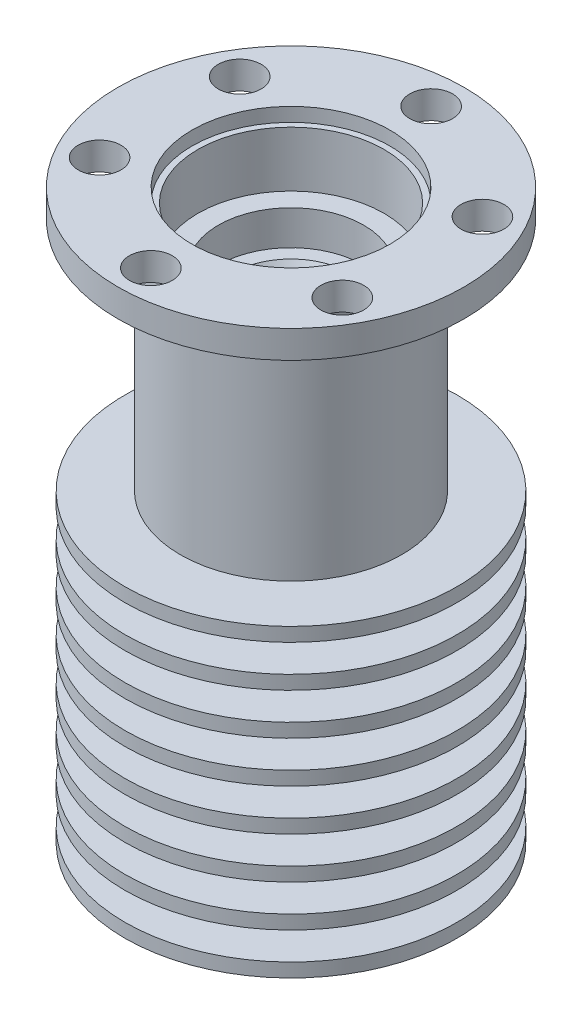
ISO-10303-21;
HEADER;
FILE_DESCRIPTION(('STEP AP214'),'2;1');
FILE_NAME('part.step','',(''),(''),'','','');
FILE_SCHEMA(('AUTOMOTIVE_DESIGN { 1 0 10303 214 1 1 1 1 }'));
ENDSEC;
DATA;
#1=APPLICATION_CONTEXT('core data for automotive mechanical design processes');
#2=APPLICATION_PROTOCOL_DEFINITION('international standard','automotive_design',2000,#1);
#3=PRODUCT_CONTEXT('',#1,'mechanical');
#4=PRODUCT('Part','Part','',(#3));
#5=PRODUCT_RELATED_PRODUCT_CATEGORY('part','',(#4));
#6=PRODUCT_DEFINITION_FORMATION('','',#4);
#7=PRODUCT_DEFINITION_CONTEXT('part definition',#1,'design');
#8=PRODUCT_DEFINITION('design','',#6,#7);
#9=PRODUCT_DEFINITION_SHAPE('','',#8);
#10=(LENGTH_UNIT() NAMED_UNIT(*) SI_UNIT(.MILLI.,.METRE.));
#11=(NAMED_UNIT(*) PLANE_ANGLE_UNIT() SI_UNIT($,.RADIAN.));
#12=(NAMED_UNIT(*) SI_UNIT($,.STERADIAN.) SOLID_ANGLE_UNIT());
#13=UNCERTAINTY_MEASURE_WITH_UNIT(LENGTH_MEASURE(1.E-05),#10,'distance_accuracy_value','');
#14=(GEOMETRIC_REPRESENTATION_CONTEXT(3) GLOBAL_UNCERTAINTY_ASSIGNED_CONTEXT((#13)) GLOBAL_UNIT_ASSIGNED_CONTEXT((#10,
#11,#12)) REPRESENTATION_CONTEXT('',''));
#15=CARTESIAN_POINT('',(0.,0.,0.));
#16=DIRECTION('',(0.,0.,1.));
#17=DIRECTION('',(1.,0.,0.));
#18=AXIS2_PLACEMENT_3D('',#15,#16,#17);
#19=CARTESIAN_POINT('',(0.,0.,0.));
#20=DIRECTION('',(0.,-1.,0.));
#21=DIRECTION('',(0.,0.,-1.));
#22=AXIS2_PLACEMENT_3D('',#19,#20,#21);
#23=CYLINDRICAL_SURFACE('',#22,6.725);
#24=CARTESIAN_POINT('',(0.,36.,0.));
#25=DIRECTION('',(0.,-1.,0.));
#26=DIRECTION('',(0.,0.,-1.));
#27=AXIS2_PLACEMENT_3D('',#24,#25,#26);
#28=CIRCLE('',#27,6.725);
#29=CARTESIAN_POINT('',(0.,36.,-6.725));
#30=VERTEX_POINT('',#29);
#31=EDGE_CURVE('E156',#30,#30,#28,.T.);
#32=ORIENTED_EDGE('',*,*,#31,.T.);
#33=EDGE_LOOP('',(#32));
#34=FACE_BOUND('',#33,.T.);
#35=CARTESIAN_POINT('',(0.,40.,0.));
#36=DIRECTION('',(0.,1.,0.));
#37=DIRECTION('',(-1.,0.,0.));
#38=AXIS2_PLACEMENT_3D('',#35,#36,#37);
#39=CIRCLE('',#38,6.725);
#40=CARTESIAN_POINT('',(-6.725,40.,0.));
#41=VERTEX_POINT('',#40);
#42=EDGE_CURVE('E69',#41,#41,#39,.F.);
#43=ORIENTED_EDGE('',*,*,#42,.F.);
#44=EDGE_LOOP('',(#43));
#45=FACE_BOUND('',#44,.T.);
#46=ADVANCED_FACE('F40',(#34,#45),#23,.F.);
#47=CARTESIAN_POINT('',(0.,41.,0.));
#48=DIRECTION('',(0.,1.,0.));
#49=DIRECTION('',(0.,0.,1.));
#50=AXIS2_PLACEMENT_3D('',#47,#48,#49);
#51=CYLINDRICAL_SURFACE('',#50,4.75);
#52=CARTESIAN_POINT('',(0.,21.,0.));
#53=DIRECTION('',(0.,-1.,0.));
#54=DIRECTION('',(0.,0.,-1.));
#55=AXIS2_PLACEMENT_3D('',#52,#53,#54);
#56=CIRCLE('',#55,4.75);
#57=CARTESIAN_POINT('',(0.,21.,-4.75));
#58=VERTEX_POINT('',#57);
#59=EDGE_CURVE('E229',#58,#58,#56,.T.);
#60=ORIENTED_EDGE('',*,*,#59,.T.);
#61=EDGE_LOOP('',(#60));
#62=FACE_BOUND('',#61,.T.);
#63=CARTESIAN_POINT('',(0.,19.,0.));
#64=DIRECTION('',(0.,-1.,0.));
#65=DIRECTION('',(0.,0.,-1.));
#66=AXIS2_PLACEMENT_3D('',#63,#64,#65);
#67=CIRCLE('',#66,4.75);
#68=CARTESIAN_POINT('',(0.,19.,-4.75));
#69=VERTEX_POINT('',#68);
#70=EDGE_CURVE('E82',#69,#69,#67,.T.);
#71=ORIENTED_EDGE('',*,*,#70,.F.);
#72=EDGE_LOOP('',(#71));
#73=FACE_BOUND('',#72,.T.);
#74=ADVANCED_FACE('F361',(#62,#73),#51,.T.);
#75=CARTESIAN_POINT('',(0.,18.,0.));
#76=DIRECTION('',(0.,-1.,0.));
#77=DIRECTION('',(0.,0.,-1.));
#78=AXIS2_PLACEMENT_3D('',#75,#76,#77);
#79=CIRCLE('',#78,4.75);
#80=CARTESIAN_POINT('',(0.,18.,-4.75));
#81=VERTEX_POINT('',#80);
#82=EDGE_CURVE('E208',#81,#81,#79,.T.);
#83=ORIENTED_EDGE('',*,*,#82,.T.);
#84=EDGE_LOOP('',(#83));
#85=FACE_BOUND('',#84,.T.);
#86=CARTESIAN_POINT('',(0.,16.,0.));
#87=DIRECTION('',(0.,-1.,0.));
#88=DIRECTION('',(0.,0.,-1.));
#89=AXIS2_PLACEMENT_3D('',#86,#87,#88);
#90=CIRCLE('',#89,4.75);
#91=CARTESIAN_POINT('',(0.,16.,-4.75));
#92=VERTEX_POINT('',#91);
#93=EDGE_CURVE('E87',#92,#92,#90,.T.);
#94=ORIENTED_EDGE('',*,*,#93,.F.);
#95=EDGE_LOOP('',(#94));
#96=FACE_BOUND('',#95,.T.);
#97=ADVANCED_FACE('F367',(#85,#96),#51,.T.);
#98=CARTESIAN_POINT('',(0.,15.,0.));
#99=DIRECTION('',(0.,-1.,0.));
#100=DIRECTION('',(0.,0.,-1.));
#101=AXIS2_PLACEMENT_3D('',#98,#99,#100);
#102=CIRCLE('',#101,4.75);
#103=CARTESIAN_POINT('',(0.,15.,-4.75));
#104=VERTEX_POINT('',#103);
#105=EDGE_CURVE('E193',#104,#104,#102,.T.);
#106=ORIENTED_EDGE('',*,*,#105,.T.);
#107=EDGE_LOOP('',(#106));
#108=FACE_BOUND('',#107,.T.);
#109=CARTESIAN_POINT('',(0.,13.,0.));
#110=DIRECTION('',(0.,-1.,0.));
#111=DIRECTION('',(0.,0.,-1.));
#112=AXIS2_PLACEMENT_3D('',#109,#110,#111);
#113=CIRCLE('',#112,4.75);
#114=CARTESIAN_POINT('',(0.,13.,-4.75));
#115=VERTEX_POINT('',#114);
#116=EDGE_CURVE('E83',#115,#115,#113,.T.);
#117=ORIENTED_EDGE('',*,*,#116,.F.);
#118=EDGE_LOOP('',(#117));
#119=FACE_BOUND('',#118,.T.);
#120=ADVANCED_FACE('F370',(#108,#119),#51,.T.);
#121=CARTESIAN_POINT('',(0.,41.,0.));
#122=DIRECTION('',(0.,1.,0.));
#123=DIRECTION('',(0.,0.,1.));
#124=AXIS2_PLACEMENT_3D('',#121,#122,#123);
#125=CYLINDRICAL_SURFACE('',#124,5.25);
#126=CARTESIAN_POINT('',(0.,12.,0.));
#127=DIRECTION('',(0.,1.,0.));
#128=DIRECTION('',(0.,0.,1.));
#129=AXIS2_PLACEMENT_3D('',#126,#127,#128);
#130=CIRCLE('',#129,5.25);
#131=CARTESIAN_POINT('',(0.,12.,5.25));
#132=VERTEX_POINT('',#131);
#133=EDGE_CURVE('E120',#132,#132,#130,.T.);
#134=ORIENTED_EDGE('',*,*,#133,.F.);
#135=EDGE_LOOP('',(#134));
#136=FACE_BOUND('',#135,.T.);
#137=CARTESIAN_POINT('',(0.,10.,0.));
#138=DIRECTION('',(0.,-1.,0.));
#139=DIRECTION('',(0.,0.,-1.));
#140=AXIS2_PLACEMENT_3D('',#137,#138,#139);
#141=CIRCLE('',#140,5.25);
#142=CARTESIAN_POINT('',(0.,10.,-5.25));
#143=VERTEX_POINT('',#142);
#144=EDGE_CURVE('E88',#143,#143,#141,.T.);
#145=ORIENTED_EDGE('',*,*,#144,.F.);
#146=EDGE_LOOP('',(#145));
#147=FACE_BOUND('',#146,.T.);
#148=ADVANCED_FACE('F411',(#136,#147),#125,.T.);
#149=CARTESIAN_POINT('',(0.,41.,0.));
#150=DIRECTION('',(0.,1.,0.));
#151=DIRECTION('',(0.,0.,1.));
#152=AXIS2_PLACEMENT_3D('',#149,#150,#151);
#153=CYLINDRICAL_SURFACE('',#152,6.);
#154=CARTESIAN_POINT('',(0.,9.,0.));
#155=DIRECTION('',(0.,1.,0.));
#156=DIRECTION('',(0.,0.,1.));
#157=AXIS2_PLACEMENT_3D('',#154,#155,#156);
#158=CIRCLE('',#157,6.);
#159=CARTESIAN_POINT('',(0.,9.,6.));
#160=VERTEX_POINT('',#159);
#161=EDGE_CURVE('E116',#160,#160,#158,.T.);
#162=ORIENTED_EDGE('',*,*,#161,.F.);
#163=EDGE_LOOP('',(#162));
#164=FACE_BOUND('',#163,.T.);
#165=CARTESIAN_POINT('',(0.,7.,0.));
#166=DIRECTION('',(0.,-1.,0.));
#167=DIRECTION('',(0.,0.,-1.));
#168=AXIS2_PLACEMENT_3D('',#165,#166,#167);
#169=CIRCLE('',#168,6.);
#170=CARTESIAN_POINT('',(0.,7.,-6.));
#171=VERTEX_POINT('',#170);
#172=EDGE_CURVE('E92',#171,#171,#169,.T.);
#173=ORIENTED_EDGE('',*,*,#172,.F.);
#174=EDGE_LOOP('',(#173));
#175=FACE_BOUND('',#174,.T.);
#176=ADVANCED_FACE('F415',(#164,#175),#153,.T.);
#177=CARTESIAN_POINT('',(0.,6.,0.));
#178=DIRECTION('',(0.,-1.,0.));
#179=DIRECTION('',(0.,0.,-1.));
#180=AXIS2_PLACEMENT_3D('',#177,#178,#179);
#181=CIRCLE('',#180,6.);
#182=CARTESIAN_POINT('',(0.,6.,-6.));
#183=VERTEX_POINT('',#182);
#184=EDGE_CURVE('E97',#183,#183,#181,.T.);
#185=ORIENTED_EDGE('',*,*,#184,.T.);
#186=EDGE_LOOP('',(#185));
#187=FACE_BOUND('',#186,.T.);
#188=CARTESIAN_POINT('',(0.,4.,0.));
#189=DIRECTION('',(0.,-1.,0.));
#190=DIRECTION('',(0.,0.,-1.));
#191=AXIS2_PLACEMENT_3D('',#188,#189,#190);
#192=CIRCLE('',#191,6.);
#193=CARTESIAN_POINT('',(0.,4.,-6.));
#194=VERTEX_POINT('',#193);
#195=EDGE_CURVE('E96',#194,#194,#192,.T.);
#196=ORIENTED_EDGE('',*,*,#195,.F.);
#197=EDGE_LOOP('',(#196));
#198=FACE_BOUND('',#197,.T.);
#199=ADVANCED_FACE('F419',(#187,#198),#153,.T.);
#200=CARTESIAN_POINT('',(0.,3.,0.));
#201=DIRECTION('',(0.,-1.,0.));
#202=DIRECTION('',(0.,0.,-1.));
#203=AXIS2_PLACEMENT_3D('',#200,#201,#202);
#204=CIRCLE('',#203,6.);
#205=CARTESIAN_POINT('',(0.,3.,-6.));
#206=VERTEX_POINT('',#205);
#207=EDGE_CURVE('E107',#206,#206,#204,.T.);
#208=ORIENTED_EDGE('',*,*,#207,.T.);
#209=EDGE_LOOP('',(#208));
#210=FACE_BOUND('',#209,.T.);
#211=CARTESIAN_POINT('',(0.,1.,0.));
#212=DIRECTION('',(0.,-1.,0.));
#213=DIRECTION('',(0.,0.,-1.));
#214=AXIS2_PLACEMENT_3D('',#211,#212,#213);
#215=CIRCLE('',#214,6.);
#216=CARTESIAN_POINT('',(0.,1.,-6.));
#217=VERTEX_POINT('',#216);
#218=EDGE_CURVE('E106',#217,#217,#215,.T.);
#219=ORIENTED_EDGE('',*,*,#218,.F.);
#220=EDGE_LOOP('',(#219));
#221=FACE_BOUND('',#220,.T.);
#222=ADVANCED_FACE('F338',(#210,#221),#153,.T.);
#223=CARTESIAN_POINT('',(0.,41.,0.));
#224=DIRECTION('',(0.,1.,0.));
#225=DIRECTION('',(0.,0.,1.));
#226=AXIS2_PLACEMENT_3D('',#223,#224,#225);
#227=CYLINDRICAL_SURFACE('',#226,8.);
#228=CARTESIAN_POINT('',(0.,39.,0.));
#229=DIRECTION('',(0.,1.,0.));
#230=DIRECTION('',(0.,0.,1.));
#231=AXIS2_PLACEMENT_3D('',#228,#229,#230);
#232=CIRCLE('',#231,8.);
#233=CARTESIAN_POINT('',(0.,39.,8.));
#234=VERTEX_POINT('',#233);
#235=EDGE_CURVE('E124',#234,#234,#232,.T.);
#236=ORIENTED_EDGE('',*,*,#235,.F.);
#237=EDGE_LOOP('',(#236));
#238=FACE_BOUND('',#237,.T.);
#239=CARTESIAN_POINT('',(0.,22.,0.));
#240=DIRECTION('',(0.,-1.,0.));
#241=DIRECTION('',(0.,0.,-1.));
#242=AXIS2_PLACEMENT_3D('',#239,#240,#241);
#243=CIRCLE('',#242,8.);
#244=CARTESIAN_POINT('',(0.,22.,-8.));
#245=VERTEX_POINT('',#244);
#246=EDGE_CURVE('E222',#245,#245,#243,.T.);
#247=ORIENTED_EDGE('',*,*,#246,.F.);
#248=EDGE_LOOP('',(#247));
#249=FACE_BOUND('',#248,.T.);
#250=ADVANCED_FACE('F331',(#238,#249),#227,.T.);
#251=CARTESIAN_POINT('',(8.,39.,0.));
#252=DIRECTION('',(0.,1.,0.));
#253=DIRECTION('',(0.,0.,1.));
#254=AXIS2_PLACEMENT_3D('',#251,#252,#253);
#255=PLANE('',#254);
#256=CARTESIAN_POINT('',(8.76850721331738,39.,-5.0625000000001));
#257=DIRECTION('',(0.,1.,0.));
#258=DIRECTION('',(0.,0.,1.));
#259=AXIS2_PLACEMENT_3D('',#256,#257,#258);
#260=CIRCLE('',#259,1.55);
#261=CARTESIAN_POINT('',(8.76850721331738,39.,-3.5125000000001));
#262=VERTEX_POINT('',#261);
#263=EDGE_CURVE('E277',#262,#262,#260,.F.);
#264=ORIENTED_EDGE('',*,*,#263,.F.);
#265=EDGE_LOOP('',(#264));
#266=FACE_BOUND('',#265,.T.);
#267=CARTESIAN_POINT('',(8.76850721331749,39.,5.06249999999992));
#268=DIRECTION('',(0.,1.,0.));
#269=DIRECTION('',(0.,0.,1.));
#270=AXIS2_PLACEMENT_3D('',#267,#268,#269);
#271=CIRCLE('',#270,1.55);
#272=CARTESIAN_POINT('',(8.76850721331749,39.,6.61249999999992));
#273=VERTEX_POINT('',#272);
#274=EDGE_CURVE('E269',#273,#273,#271,.F.);
#275=ORIENTED_EDGE('',*,*,#274,.F.);
#276=EDGE_LOOP('',(#275));
#277=FACE_BOUND('',#276,.T.);
#278=CARTESIAN_POINT('',(0.,39.,10.125));
#279=DIRECTION('',(0.,1.,0.));
#280=DIRECTION('',(0.,0.,1.));
#281=AXIS2_PLACEMENT_3D('',#278,#279,#280);
#282=CIRCLE('',#281,1.55);
#283=CARTESIAN_POINT('',(0.,39.,11.675));
#284=VERTEX_POINT('',#283);
#285=EDGE_CURVE('E261',#284,#284,#282,.F.);
#286=ORIENTED_EDGE('',*,*,#285,.F.);
#287=EDGE_LOOP('',(#286));
#288=FACE_BOUND('',#287,.T.);
#289=CARTESIAN_POINT('',(-8.76850721331742,39.,5.06250000000004));
#290=DIRECTION('',(0.,1.,0.));
#291=DIRECTION('',(0.,0.,1.));
#292=AXIS2_PLACEMENT_3D('',#289,#290,#291);
#293=CIRCLE('',#292,1.55);
#294=CARTESIAN_POINT('',(-8.76850721331742,39.,6.61250000000004));
#295=VERTEX_POINT('',#294);
#296=EDGE_CURVE('E253',#295,#295,#293,.F.);
#297=ORIENTED_EDGE('',*,*,#296,.F.);
#298=EDGE_LOOP('',(#297));
#299=FACE_BOUND('',#298,.T.);
#300=CARTESIAN_POINT('',(-8.76850721331745,39.,-5.06249999999998));
#301=DIRECTION('',(0.,1.,0.));
#302=DIRECTION('',(0.,0.,1.));
#303=AXIS2_PLACEMENT_3D('',#300,#301,#302);
#304=CIRCLE('',#303,1.55);
#305=CARTESIAN_POINT('',(-8.76850721331745,39.,-3.51249999999998));
#306=VERTEX_POINT('',#305);
#307=EDGE_CURVE('E245',#306,#306,#304,.F.);
#308=ORIENTED_EDGE('',*,*,#307,.F.);
#309=EDGE_LOOP('',(#308));
#310=FACE_BOUND('',#309,.T.);
#311=CARTESIAN_POINT('',(0.,39.,-10.125));
#312=DIRECTION('',(0.,1.,0.));
#313=DIRECTION('',(0.,0.,1.));
#314=AXIS2_PLACEMENT_3D('',#311,#312,#313);
#315=CIRCLE('',#314,1.55);
#316=CARTESIAN_POINT('',(0.,39.,-8.575));
#317=VERTEX_POINT('',#316);
#318=EDGE_CURVE('E237',#317,#317,#315,.F.);
#319=ORIENTED_EDGE('',*,*,#318,.F.);
#320=EDGE_LOOP('',(#319));
#321=FACE_BOUND('',#320,.T.);
#322=CARTESIAN_POINT('',(0.,39.,0.));
#323=DIRECTION('',(0.,1.,0.));
#324=DIRECTION('',(0.,0.,1.));
#325=AXIS2_PLACEMENT_3D('',#322,#323,#324);
#326=CIRCLE('',#325,12.5);
#327=CARTESIAN_POINT('',(0.,39.,12.5));
#328=VERTEX_POINT('',#327);
#329=EDGE_CURVE('E128',#328,#328,#326,.T.);
#330=ORIENTED_EDGE('',*,*,#329,.F.);
#331=EDGE_LOOP('',(#330));
#332=FACE_BOUND('',#331,.T.);
#333=ORIENTED_EDGE('',*,*,#235,.T.);
#334=EDGE_LOOP('',(#333));
#335=FACE_BOUND('',#334,.T.);
#336=ADVANCED_FACE('F325',(#266,#277,#288,#299,#310,#321,#332,#335),#255,.F.);
#337=CARTESIAN_POINT('',(0.,41.,0.));
#338=DIRECTION('',(0.,1.,0.));
#339=DIRECTION('',(0.,0.,1.));
#340=AXIS2_PLACEMENT_3D('',#337,#338,#339);
#341=CYLINDRICAL_SURFACE('',#340,12.5);
#342=CARTESIAN_POINT('',(0.,41.,0.));
#343=DIRECTION('',(0.,1.,0.));
#344=DIRECTION('',(0.,0.,1.));
#345=AXIS2_PLACEMENT_3D('',#342,#343,#344);
#346=CIRCLE('',#345,12.5);
#347=CARTESIAN_POINT('',(0.,41.,12.5));
#348=VERTEX_POINT('',#347);
#349=EDGE_CURVE('E132',#348,#348,#346,.T.);
#350=ORIENTED_EDGE('',*,*,#349,.F.);
#351=EDGE_LOOP('',(#350));
#352=FACE_BOUND('',#351,.T.);
#353=ORIENTED_EDGE('',*,*,#329,.T.);
#354=EDGE_LOOP('',(#353));
#355=FACE_BOUND('',#354,.T.);
#356=ADVANCED_FACE('F307',(#352,#355),#341,.T.);
#357=CARTESIAN_POINT('',(12.5,41.,0.));
#358=DIRECTION('',(0.,-1.,0.));
#359=DIRECTION('',(0.,0.,-1.));
#360=AXIS2_PLACEMENT_3D('',#357,#358,#359);
#361=PLANE('',#360);
#362=CARTESIAN_POINT('',(0.,41.,0.));
#363=DIRECTION('',(0.,1.,0.));
#364=DIRECTION('',(-1.,0.,0.));
#365=AXIS2_PLACEMENT_3D('',#362,#363,#364);
#366=CIRCLE('',#365,7.15);
#367=CARTESIAN_POINT('',(-7.15,41.,0.));
#368=VERTEX_POINT('',#367);
#369=EDGE_CURVE('E285',#368,#368,#366,.T.);
#370=ORIENTED_EDGE('',*,*,#369,.F.);
#371=EDGE_LOOP('',(#370));
#372=FACE_BOUND('',#371,.T.);
#373=CARTESIAN_POINT('',(8.76850721331738,41.,-5.0625000000001));
#374=DIRECTION('',(0.,1.,0.));
#375=DIRECTION('',(-0.50000000000001,0.,-0.866025403784433));
#376=AXIS2_PLACEMENT_3D('',#373,#374,#375);
#377=CIRCLE('',#376,1.55);
#378=CARTESIAN_POINT('',(7.99350721331737,41.,-6.40483937586597));
#379=VERTEX_POINT('',#378);
#380=EDGE_CURVE('E73',#379,#379,#377,.T.);
#381=ORIENTED_EDGE('',*,*,#380,.F.);
#382=EDGE_LOOP('',(#381));
#383=FACE_BOUND('',#382,.T.);
#384=CARTESIAN_POINT('',(8.76850721331749,41.,5.06249999999992));
#385=DIRECTION('',(0.,1.,0.));
#386=DIRECTION('',(0.499999999999992,0.,-0.866025403784443));
#387=AXIS2_PLACEMENT_3D('',#384,#385,#386);
#388=CIRCLE('',#387,1.55);
#389=CARTESIAN_POINT('',(9.54350721331748,41.,3.72016062413403));
#390=VERTEX_POINT('',#389);
#391=EDGE_CURVE('E273',#390,#390,#388,.T.);
#392=ORIENTED_EDGE('',*,*,#391,.F.);
#393=EDGE_LOOP('',(#392));
#394=FACE_BOUND('',#393,.T.);
#395=CARTESIAN_POINT('',(0.,41.,10.125));
#396=DIRECTION('',(0.,1.,0.));
#397=DIRECTION('',(1.,0.,0.));
#398=AXIS2_PLACEMENT_3D('',#395,#396,#397);
#399=CIRCLE('',#398,1.55);
#400=CARTESIAN_POINT('',(1.55,41.,10.125));
#401=VERTEX_POINT('',#400);
#402=EDGE_CURVE('E265',#401,#401,#399,.T.);
#403=ORIENTED_EDGE('',*,*,#402,.F.);
#404=EDGE_LOOP('',(#403));
#405=FACE_BOUND('',#404,.T.);
#406=CARTESIAN_POINT('',(-8.76850721331742,41.,5.06250000000004));
#407=DIRECTION('',(0.,1.,0.));
#408=DIRECTION('',(0.500000000000004,0.,0.866025403784436));
#409=AXIS2_PLACEMENT_3D('',#406,#407,#408);
#410=CIRCLE('',#409,1.55);
#411=CARTESIAN_POINT('',(-7.99350721331741,41.,6.40483937586592));
#412=VERTEX_POINT('',#411);
#413=EDGE_CURVE('E257',#412,#412,#410,.T.);
#414=ORIENTED_EDGE('',*,*,#413,.F.);
#415=EDGE_LOOP('',(#414));
#416=FACE_BOUND('',#415,.T.);
#417=CARTESIAN_POINT('',(-8.76850721331745,41.,-5.06249999999998));
#418=DIRECTION('',(0.,1.,0.));
#419=DIRECTION('',(-0.499999999999998,0.,0.86602540378444));
#420=AXIS2_PLACEMENT_3D('',#417,#418,#419);
#421=CIRCLE('',#420,1.55);
#422=CARTESIAN_POINT('',(-9.54350721331745,41.,-3.7201606241341));
#423=VERTEX_POINT('',#422);
#424=EDGE_CURVE('E249',#423,#423,#421,.T.);
#425=ORIENTED_EDGE('',*,*,#424,.F.);
#426=EDGE_LOOP('',(#425));
#427=FACE_BOUND('',#426,.T.);
#428=CARTESIAN_POINT('',(0.,41.,-10.125));
#429=DIRECTION('',(0.,1.,0.));
#430=DIRECTION('',(-1.,0.,0.));
#431=AXIS2_PLACEMENT_3D('',#428,#429,#430);
#432=CIRCLE('',#431,1.55);
#433=CARTESIAN_POINT('',(-1.55,41.,-10.125));
#434=VERTEX_POINT('',#433);
#435=EDGE_CURVE('E241',#434,#434,#432,.T.);
#436=ORIENTED_EDGE('',*,*,#435,.F.);
#437=EDGE_LOOP('',(#436));
#438=FACE_BOUND('',#437,.T.);
#439=ORIENTED_EDGE('',*,*,#349,.T.);
#440=EDGE_LOOP('',(#439));
#441=FACE_BOUND('',#440,.T.);
#442=ADVANCED_FACE('F303',(#372,#383,#394,#405,#416,#427,#438,#441),#361,.F.);
#443=CARTESIAN_POINT('',(0.,0.,0.));
#444=DIRECTION('',(0.,1.,0.));
#445=DIRECTION('',(0.,0.,1.));
#446=AXIS2_PLACEMENT_3D('',#443,#444,#445);
#447=PLANE('',#446);
#448=CARTESIAN_POINT('',(0.,0.,0.));
#449=DIRECTION('',(0.,-1.,0.));
#450=DIRECTION('',(0.,0.,-1.));
#451=AXIS2_PLACEMENT_3D('',#448,#449,#450);
#452=CIRCLE('',#451,2.5);
#453=CARTESIAN_POINT('',(0.,0.,-2.5));
#454=VERTEX_POINT('',#453);
#455=EDGE_CURVE('E136',#454,#454,#452,.T.);
#456=ORIENTED_EDGE('',*,*,#455,.F.);
#457=EDGE_LOOP('',(#456));
#458=FACE_BOUND('',#457,.T.);
#459=CARTESIAN_POINT('',(0.,0.,0.));
#460=DIRECTION('',(0.,-1.,0.));
#461=DIRECTION('',(0.,0.,-1.));
#462=AXIS2_PLACEMENT_3D('',#459,#460,#461);
#463=CIRCLE('',#462,12.);
#464=CARTESIAN_POINT('',(0.,0.,-12.));
#465=VERTEX_POINT('',#464);
#466=EDGE_CURVE('E111',#465,#465,#463,.T.);
#467=ORIENTED_EDGE('',*,*,#466,.T.);
#468=EDGE_LOOP('',(#467));
#469=FACE_BOUND('',#468,.T.);
#470=ADVANCED_FACE('F306',(#458,#469),#447,.F.);
#471=CARTESIAN_POINT('',(0.,0.,0.));
#472=DIRECTION('',(0.,-1.,0.));
#473=DIRECTION('',(0.,0.,-1.));
#474=AXIS2_PLACEMENT_3D('',#471,#472,#473);
#475=CYLINDRICAL_SURFACE('',#474,2.5);
#476=CARTESIAN_POINT('',(0.,12.,0.));
#477=DIRECTION('',(0.,-1.,0.));
#478=DIRECTION('',(0.,0.,-1.));
#479=AXIS2_PLACEMENT_3D('',#476,#477,#478);
#480=CIRCLE('',#479,2.5);
#481=CARTESIAN_POINT('',(0.,12.,-2.5));
#482=VERTEX_POINT('',#481);
#483=EDGE_CURVE('E140',#482,#482,#480,.T.);
#484=ORIENTED_EDGE('',*,*,#483,.F.);
#485=EDGE_LOOP('',(#484));
#486=FACE_BOUND('',#485,.T.);
#487=ORIENTED_EDGE('',*,*,#455,.T.);
#488=EDGE_LOOP('',(#487));
#489=FACE_BOUND('',#488,.T.);
#490=ADVANCED_FACE('F402',(#486,#489),#475,.F.);
#491=CARTESIAN_POINT('',(2.5,12.,0.));
#492=DIRECTION('',(0.,1.,0.));
#493=DIRECTION('',(0.,0.,1.));
#494=AXIS2_PLACEMENT_3D('',#491,#492,#493);
#495=PLANE('',#494);
#496=CARTESIAN_POINT('',(0.,12.,0.));
#497=DIRECTION('',(0.,1.,0.));
#498=DIRECTION('',(0.,0.,1.));
#499=AXIS2_PLACEMENT_3D('',#496,#497,#498);
#500=CIRCLE('',#499,1.85);
#501=CARTESIAN_POINT('',(0.,12.,1.85));
#502=VERTEX_POINT('',#501);
#503=EDGE_CURVE('E55',#502,#502,#500,.T.);
#504=ORIENTED_EDGE('',*,*,#503,.T.);
#505=EDGE_LOOP('',(#504));
#506=FACE_BOUND('',#505,.T.);
#507=ORIENTED_EDGE('',*,*,#483,.T.);
#508=EDGE_LOOP('',(#507));
#509=FACE_BOUND('',#508,.T.);
#510=ADVANCED_FACE('F398',(#506,#509),#495,.F.);
#511=CARTESIAN_POINT('',(0.,0.,0.));
#512=DIRECTION('',(0.,-1.,0.));
#513=DIRECTION('',(0.,0.,-1.));
#514=AXIS2_PLACEMENT_3D('',#511,#512,#513);
#515=CYLINDRICAL_SURFACE('',#514,1.7);
#516=CARTESIAN_POINT('',(0.,12.2598076211353,0.));
#517=DIRECTION('',(0.,1.,0.));
#518=DIRECTION('',(0.,0.,1.));
#519=AXIS2_PLACEMENT_3D('',#516,#517,#518);
#520=CIRCLE('',#519,1.7);
#521=CARTESIAN_POINT('',(0.,12.2598076211353,1.7));
#522=VERTEX_POINT('',#521);
#523=EDGE_CURVE('E62',#522,#522,#520,.F.);
#524=ORIENTED_EDGE('',*,*,#523,.T.);
#525=EDGE_LOOP('',(#524));
#526=FACE_BOUND('',#525,.T.);
#527=CARTESIAN_POINT('',(0.,13.4803847577293,0.));
#528=DIRECTION('',(0.,-1.,0.));
#529=DIRECTION('',(0.,0.,-1.));
#530=AXIS2_PLACEMENT_3D('',#527,#528,#529);
#531=CIRCLE('',#530,1.7);
#532=CARTESIAN_POINT('',(0.,13.4803847577293,-1.7));
#533=VERTEX_POINT('',#532);
#534=EDGE_CURVE('E68',#533,#533,#531,.F.);
#535=ORIENTED_EDGE('',*,*,#534,.T.);
#536=EDGE_LOOP('',(#535));
#537=FACE_BOUND('',#536,.T.);
#538=ADVANCED_FACE('F394',(#526,#537),#515,.F.);
#539=CARTESIAN_POINT('',(1.7,14.,0.));
#540=DIRECTION('',(0.,-1.,0.));
#541=DIRECTION('',(0.,0.,-1.));
#542=AXIS2_PLACEMENT_3D('',#539,#540,#541);
#543=PLANE('',#542);
#544=CARTESIAN_POINT('',(0.,14.,0.));
#545=DIRECTION('',(0.,-1.,0.));
#546=DIRECTION('',(0.,0.,-1.));
#547=AXIS2_PLACEMENT_3D('',#544,#545,#546);
#548=CIRCLE('',#547,2.00000000000001);
#549=CARTESIAN_POINT('',(0.,14.,-2.00000000000001));
#550=VERTEX_POINT('',#549);
#551=EDGE_CURVE('E78',#550,#550,#548,.T.);
#552=ORIENTED_EDGE('',*,*,#551,.T.);
#553=EDGE_LOOP('',(#552));
#554=FACE_BOUND('',#553,.T.);
#555=CARTESIAN_POINT('',(0.,14.,0.));
#556=DIRECTION('',(0.,-1.,0.));
#557=DIRECTION('',(0.,0.,-1.));
#558=AXIS2_PLACEMENT_3D('',#555,#556,#557);
#559=CIRCLE('',#558,3.25);
#560=CARTESIAN_POINT('',(0.,14.,-3.25));
#561=VERTEX_POINT('',#560);
#562=EDGE_CURVE('E144',#561,#561,#559,.T.);
#563=ORIENTED_EDGE('',*,*,#562,.F.);
#564=EDGE_LOOP('',(#563));
#565=FACE_BOUND('',#564,.T.);
#566=ADVANCED_FACE('F391',(#554,#565),#543,.F.);
#567=CARTESIAN_POINT('',(0.,0.,0.));
#568=DIRECTION('',(0.,-1.,0.));
#569=DIRECTION('',(0.,0.,-1.));
#570=AXIS2_PLACEMENT_3D('',#567,#568,#569);
#571=CYLINDRICAL_SURFACE('',#570,3.25);
#572=CARTESIAN_POINT('',(0.,31.7679491924311,0.));
#573=DIRECTION('',(0.,-1.,0.));
#574=DIRECTION('',(0.,0.,-1.));
#575=AXIS2_PLACEMENT_3D('',#572,#573,#574);
#576=CIRCLE('',#575,3.25);
#577=CARTESIAN_POINT('',(0.,31.7679491924311,-3.25));
#578=VERTEX_POINT('',#577);
#579=EDGE_CURVE('E10',#578,#578,#576,.F.);
#580=ORIENTED_EDGE('',*,*,#579,.T.);
#581=EDGE_LOOP('',(#580));
#582=FACE_BOUND('',#581,.T.);
#583=ORIENTED_EDGE('',*,*,#562,.T.);
#584=EDGE_LOOP('',(#583));
#585=FACE_BOUND('',#584,.T.);
#586=ADVANCED_FACE('F388',(#582,#585),#571,.F.);
#587=CARTESIAN_POINT('',(3.25,33.5,0.));
#588=DIRECTION('',(0.,-1.,0.));
#589=DIRECTION('',(0.,0.,-1.));
#590=AXIS2_PLACEMENT_3D('',#587,#588,#589);
#591=PLANE('',#590);
#592=CARTESIAN_POINT('',(0.,33.5,0.));
#593=DIRECTION('',(0.,-1.,0.));
#594=DIRECTION('',(0.,0.,-1.));
#595=AXIS2_PLACEMENT_3D('',#592,#593,#594);
#596=CIRCLE('',#595,4.25);
#597=CARTESIAN_POINT('',(0.,33.5,-4.25));
#598=VERTEX_POINT('',#597);
#599=EDGE_CURVE('E48',#598,#598,#596,.T.);
#600=ORIENTED_EDGE('',*,*,#599,.T.);
#601=EDGE_LOOP('',(#600));
#602=FACE_BOUND('',#601,.T.);
#603=CARTESIAN_POINT('',(0.,33.5,0.));
#604=DIRECTION('',(0.,-1.,0.));
#605=DIRECTION('',(0.,0.,-1.));
#606=AXIS2_PLACEMENT_3D('',#603,#604,#605);
#607=CIRCLE('',#606,5.25);
#608=CARTESIAN_POINT('',(0.,33.5,-5.25));
#609=VERTEX_POINT('',#608);
#610=EDGE_CURVE('E148',#609,#609,#607,.T.);
#611=ORIENTED_EDGE('',*,*,#610,.F.);
#612=EDGE_LOOP('',(#611));
#613=FACE_BOUND('',#612,.T.);
#614=ADVANCED_FACE('F384',(#602,#613),#591,.F.);
#615=CARTESIAN_POINT('',(0.,0.,0.));
#616=DIRECTION('',(0.,-1.,0.));
#617=DIRECTION('',(0.,0.,-1.));
#618=AXIS2_PLACEMENT_3D('',#615,#616,#617);
#619=CYLINDRICAL_SURFACE('',#618,5.25);
#620=CARTESIAN_POINT('',(0.,36.,0.));
#621=DIRECTION('',(0.,-1.,0.));
#622=DIRECTION('',(0.,0.,-1.));
#623=AXIS2_PLACEMENT_3D('',#620,#621,#622);
#624=CIRCLE('',#623,5.25);
#625=CARTESIAN_POINT('',(0.,36.,-5.25));
#626=VERTEX_POINT('',#625);
#627=EDGE_CURVE('E152',#626,#626,#624,.T.);
#628=ORIENTED_EDGE('',*,*,#627,.F.);
#629=EDGE_LOOP('',(#628));
#630=FACE_BOUND('',#629,.T.);
#631=ORIENTED_EDGE('',*,*,#610,.T.);
#632=EDGE_LOOP('',(#631));
#633=FACE_BOUND('',#632,.T.);
#634=ADVANCED_FACE('F380',(#630,#633),#619,.F.);
#635=CARTESIAN_POINT('',(5.25,36.,0.));
#636=DIRECTION('',(0.,-1.,0.));
#637=DIRECTION('',(0.,0.,-1.));
#638=AXIS2_PLACEMENT_3D('',#635,#636,#637);
#639=PLANE('',#638);
#640=ORIENTED_EDGE('',*,*,#31,.F.);
#641=EDGE_LOOP('',(#640));
#642=FACE_BOUND('',#641,.T.);
#643=ORIENTED_EDGE('',*,*,#627,.T.);
#644=EDGE_LOOP('',(#643));
#645=FACE_BOUND('',#644,.T.);
#646=ADVANCED_FACE('F376',(#642,#645),#639,.F.);
#647=CARTESIAN_POINT('',(0.,1.,0.));
#648=DIRECTION('',(0.,-1.,0.));
#649=DIRECTION('',(0.,0.,-1.));
#650=AXIS2_PLACEMENT_3D('',#647,#648,#649);
#651=PLANE('',#650);
#652=CARTESIAN_POINT('',(0.,1.,0.));
#653=DIRECTION('',(0.,-1.,0.));
#654=DIRECTION('',(0.,0.,-1.));
#655=AXIS2_PLACEMENT_3D('',#652,#653,#654);
#656=CIRCLE('',#655,12.);
#657=CARTESIAN_POINT('',(0.,1.,-12.));
#658=VERTEX_POINT('',#657);
#659=EDGE_CURVE('E160',#658,#658,#656,.T.);
#660=ORIENTED_EDGE('',*,*,#659,.F.);
#661=EDGE_LOOP('',(#660));
#662=FACE_BOUND('',#661,.T.);
#663=ORIENTED_EDGE('',*,*,#218,.T.);
#664=EDGE_LOOP('',(#663));
#665=FACE_BOUND('',#664,.T.);
#666=ADVANCED_FACE('F379',(#662,#665),#651,.F.);
#667=CARTESIAN_POINT('',(0.,1.,0.));
#668=DIRECTION('',(0.,-1.,0.));
#669=DIRECTION('',(0.,0.,-1.));
#670=AXIS2_PLACEMENT_3D('',#667,#668,#669);
#671=CYLINDRICAL_SURFACE('',#670,12.);
#672=ORIENTED_EDGE('',*,*,#659,.T.);
#673=EDGE_LOOP('',(#672));
#674=FACE_BOUND('',#673,.T.);
#675=ORIENTED_EDGE('',*,*,#466,.F.);
#676=EDGE_LOOP('',(#675));
#677=FACE_BOUND('',#676,.T.);
#678=ADVANCED_FACE('F374',(#674,#677),#671,.T.);
#679=CARTESIAN_POINT('',(0.,4.,0.));
#680=DIRECTION('',(0.,-1.,0.));
#681=DIRECTION('',(0.,0.,-1.));
#682=AXIS2_PLACEMENT_3D('',#679,#680,#681);
#683=PLANE('',#682);
#684=CARTESIAN_POINT('',(0.,4.,0.));
#685=DIRECTION('',(0.,-1.,0.));
#686=DIRECTION('',(0.,0.,-1.));
#687=AXIS2_PLACEMENT_3D('',#684,#685,#686);
#688=CIRCLE('',#687,12.);
#689=CARTESIAN_POINT('',(0.,4.,-12.));
#690=VERTEX_POINT('',#689);
#691=EDGE_CURVE('E112',#690,#690,#688,.T.);
#692=ORIENTED_EDGE('',*,*,#691,.F.);
#693=EDGE_LOOP('',(#692));
#694=FACE_BOUND('',#693,.T.);
#695=ORIENTED_EDGE('',*,*,#195,.T.);
#696=EDGE_LOOP('',(#695));
#697=FACE_BOUND('',#696,.T.);
#698=ADVANCED_FACE('F449',(#694,#697),#683,.F.);
#699=CARTESIAN_POINT('',(0.,3.,0.));
#700=DIRECTION('',(0.,-1.,0.));
#701=DIRECTION('',(0.,0.,-1.));
#702=AXIS2_PLACEMENT_3D('',#699,#700,#701);
#703=PLANE('',#702);
#704=CARTESIAN_POINT('',(0.,3.,0.));
#705=DIRECTION('',(0.,-1.,0.));
#706=DIRECTION('',(0.,0.,-1.));
#707=AXIS2_PLACEMENT_3D('',#704,#705,#706);
#708=CIRCLE('',#707,12.);
#709=CARTESIAN_POINT('',(0.,3.,-12.));
#710=VERTEX_POINT('',#709);
#711=EDGE_CURVE('E101',#710,#710,#708,.T.);
#712=ORIENTED_EDGE('',*,*,#711,.T.);
#713=EDGE_LOOP('',(#712));
#714=FACE_BOUND('',#713,.T.);
#715=ORIENTED_EDGE('',*,*,#207,.F.);
#716=EDGE_LOOP('',(#715));
#717=FACE_BOUND('',#716,.T.);
#718=ADVANCED_FACE('F455',(#714,#717),#703,.T.);
#719=CARTESIAN_POINT('',(0.,4.,0.));
#720=DIRECTION('',(0.,-1.,0.));
#721=DIRECTION('',(0.,0.,-1.));
#722=AXIS2_PLACEMENT_3D('',#719,#720,#721);
#723=CYLINDRICAL_SURFACE('',#722,12.);
#724=ORIENTED_EDGE('',*,*,#691,.T.);
#725=EDGE_LOOP('',(#724));
#726=FACE_BOUND('',#725,.T.);
#727=ORIENTED_EDGE('',*,*,#711,.F.);
#728=EDGE_LOOP('',(#727));
#729=FACE_BOUND('',#728,.T.);
#730=ADVANCED_FACE('F466',(#726,#729),#723,.T.);
#731=CARTESIAN_POINT('',(0.,7.,0.));
#732=DIRECTION('',(0.,-1.,0.));
#733=DIRECTION('',(0.,0.,-1.));
#734=AXIS2_PLACEMENT_3D('',#731,#732,#733);
#735=PLANE('',#734);
#736=CARTESIAN_POINT('',(0.,7.,0.));
#737=DIRECTION('',(0.,-1.,0.));
#738=DIRECTION('',(0.,0.,-1.));
#739=AXIS2_PLACEMENT_3D('',#736,#737,#738);
#740=CIRCLE('',#739,12.);
#741=CARTESIAN_POINT('',(0.,7.,-12.));
#742=VERTEX_POINT('',#741);
#743=EDGE_CURVE('E102',#742,#742,#740,.T.);
#744=ORIENTED_EDGE('',*,*,#743,.F.);
#745=EDGE_LOOP('',(#744));
#746=FACE_BOUND('',#745,.T.);
#747=ORIENTED_EDGE('',*,*,#172,.T.);
#748=EDGE_LOOP('',(#747));
#749=FACE_BOUND('',#748,.T.);
#750=ADVANCED_FACE('F469',(#746,#749),#735,.F.);
#751=CARTESIAN_POINT('',(0.,6.,0.));
#752=DIRECTION('',(0.,-1.,0.));
#753=DIRECTION('',(0.,0.,-1.));
#754=AXIS2_PLACEMENT_3D('',#751,#752,#753);
#755=PLANE('',#754);
#756=CARTESIAN_POINT('',(0.,6.,0.));
#757=DIRECTION('',(0.,-1.,0.));
#758=DIRECTION('',(0.,0.,-1.));
#759=AXIS2_PLACEMENT_3D('',#756,#757,#758);
#760=CIRCLE('',#759,12.);
#761=CARTESIAN_POINT('',(0.,6.,-12.));
#762=VERTEX_POINT('',#761);
#763=EDGE_CURVE('E173',#762,#762,#760,.T.);
#764=ORIENTED_EDGE('',*,*,#763,.T.);
#765=EDGE_LOOP('',(#764));
#766=FACE_BOUND('',#765,.T.);
#767=ORIENTED_EDGE('',*,*,#184,.F.);
#768=EDGE_LOOP('',(#767));
#769=FACE_BOUND('',#768,.T.);
#770=ADVANCED_FACE('F478',(#766,#769),#755,.T.);
#771=CARTESIAN_POINT('',(0.,7.,0.));
#772=DIRECTION('',(0.,-1.,0.));
#773=DIRECTION('',(0.,0.,-1.));
#774=AXIS2_PLACEMENT_3D('',#771,#772,#773);
#775=CYLINDRICAL_SURFACE('',#774,12.);
#776=ORIENTED_EDGE('',*,*,#743,.T.);
#777=EDGE_LOOP('',(#776));
#778=FACE_BOUND('',#777,.T.);
#779=ORIENTED_EDGE('',*,*,#763,.F.);
#780=EDGE_LOOP('',(#779));
#781=FACE_BOUND('',#780,.T.);
#782=ADVANCED_FACE('F474',(#778,#781),#775,.T.);
#783=CARTESIAN_POINT('',(0.,10.,0.));
#784=DIRECTION('',(0.,-1.,0.));
#785=DIRECTION('',(0.,0.,-1.));
#786=AXIS2_PLACEMENT_3D('',#783,#784,#785);
#787=PLANE('',#786);
#788=CARTESIAN_POINT('',(0.,10.,0.));
#789=DIRECTION('',(0.,-1.,0.));
#790=DIRECTION('',(0.,0.,-1.));
#791=AXIS2_PLACEMENT_3D('',#788,#789,#790);
#792=CIRCLE('',#791,12.);
#793=CARTESIAN_POINT('',(0.,10.,-12.));
#794=VERTEX_POINT('',#793);
#795=EDGE_CURVE('E177',#794,#794,#792,.T.);
#796=ORIENTED_EDGE('',*,*,#795,.F.);
#797=EDGE_LOOP('',(#796));
#798=FACE_BOUND('',#797,.T.);
#799=ORIENTED_EDGE('',*,*,#144,.T.);
#800=EDGE_LOOP('',(#799));
#801=FACE_BOUND('',#800,.T.);
#802=ADVANCED_FACE('F477',(#798,#801),#787,.F.);
#803=CARTESIAN_POINT('',(0.,9.,0.));
#804=DIRECTION('',(0.,-1.,0.));
#805=DIRECTION('',(0.,0.,-1.));
#806=AXIS2_PLACEMENT_3D('',#803,#804,#805);
#807=PLANE('',#806);
#808=CARTESIAN_POINT('',(0.,9.,0.));
#809=DIRECTION('',(0.,-1.,0.));
#810=DIRECTION('',(0.,0.,-1.));
#811=AXIS2_PLACEMENT_3D('',#808,#809,#810);
#812=CIRCLE('',#811,12.);
#813=CARTESIAN_POINT('',(0.,9.,-12.));
#814=VERTEX_POINT('',#813);
#815=EDGE_CURVE('E181',#814,#814,#812,.T.);
#816=ORIENTED_EDGE('',*,*,#815,.T.);
#817=EDGE_LOOP('',(#816));
#818=FACE_BOUND('',#817,.T.);
#819=ORIENTED_EDGE('',*,*,#161,.T.);
#820=EDGE_LOOP('',(#819));
#821=FACE_BOUND('',#820,.T.);
#822=ADVANCED_FACE('F490',(#818,#821),#807,.T.);
#823=CARTESIAN_POINT('',(0.,10.,0.));
#824=DIRECTION('',(0.,-1.,0.));
#825=DIRECTION('',(0.,0.,-1.));
#826=AXIS2_PLACEMENT_3D('',#823,#824,#825);
#827=CYLINDRICAL_SURFACE('',#826,12.);
#828=ORIENTED_EDGE('',*,*,#795,.T.);
#829=EDGE_LOOP('',(#828));
#830=FACE_BOUND('',#829,.T.);
#831=ORIENTED_EDGE('',*,*,#815,.F.);
#832=EDGE_LOOP('',(#831));
#833=FACE_BOUND('',#832,.T.);
#834=ADVANCED_FACE('F486',(#830,#833),#827,.T.);
#835=CARTESIAN_POINT('',(0.,13.,0.));
#836=DIRECTION('',(0.,-1.,0.));
#837=DIRECTION('',(0.,0.,-1.));
#838=AXIS2_PLACEMENT_3D('',#835,#836,#837);
#839=PLANE('',#838);
#840=CARTESIAN_POINT('',(0.,13.,0.));
#841=DIRECTION('',(0.,-1.,0.));
#842=DIRECTION('',(0.,0.,-1.));
#843=AXIS2_PLACEMENT_3D('',#840,#841,#842);
#844=CIRCLE('',#843,12.);
#845=CARTESIAN_POINT('',(0.,13.,-12.));
#846=VERTEX_POINT('',#845);
#847=EDGE_CURVE('E185',#846,#846,#844,.T.);
#848=ORIENTED_EDGE('',*,*,#847,.F.);
#849=EDGE_LOOP('',(#848));
#850=FACE_BOUND('',#849,.T.);
#851=ORIENTED_EDGE('',*,*,#116,.T.);
#852=EDGE_LOOP('',(#851));
#853=FACE_BOUND('',#852,.T.);
#854=ADVANCED_FACE('F489',(#850,#853),#839,.F.);
#855=CARTESIAN_POINT('',(0.,12.,0.));
#856=DIRECTION('',(0.,-1.,0.));
#857=DIRECTION('',(0.,0.,-1.));
#858=AXIS2_PLACEMENT_3D('',#855,#856,#857);
#859=PLANE('',#858);
#860=CARTESIAN_POINT('',(0.,12.,0.));
#861=DIRECTION('',(0.,-1.,0.));
#862=DIRECTION('',(0.,0.,-1.));
#863=AXIS2_PLACEMENT_3D('',#860,#861,#862);
#864=CIRCLE('',#863,12.);
#865=CARTESIAN_POINT('',(0.,12.,-12.));
#866=VERTEX_POINT('',#865);
#867=EDGE_CURVE('E189',#866,#866,#864,.T.);
#868=ORIENTED_EDGE('',*,*,#867,.T.);
#869=EDGE_LOOP('',(#868));
#870=FACE_BOUND('',#869,.T.);
#871=ORIENTED_EDGE('',*,*,#133,.T.);
#872=EDGE_LOOP('',(#871));
#873=FACE_BOUND('',#872,.T.);
#874=ADVANCED_FACE('F502',(#870,#873),#859,.T.);
#875=CARTESIAN_POINT('',(0.,13.,0.));
#876=DIRECTION('',(0.,-1.,0.));
#877=DIRECTION('',(0.,0.,-1.));
#878=AXIS2_PLACEMENT_3D('',#875,#876,#877);
#879=CYLINDRICAL_SURFACE('',#878,12.);
#880=ORIENTED_EDGE('',*,*,#847,.T.);
#881=EDGE_LOOP('',(#880));
#882=FACE_BOUND('',#881,.T.);
#883=ORIENTED_EDGE('',*,*,#867,.F.);
#884=EDGE_LOOP('',(#883));
#885=FACE_BOUND('',#884,.T.);
#886=ADVANCED_FACE('F498',(#882,#885),#879,.T.);
#887=CARTESIAN_POINT('',(0.,16.,0.));
#888=DIRECTION('',(0.,-1.,0.));
#889=DIRECTION('',(0.,0.,-1.));
#890=AXIS2_PLACEMENT_3D('',#887,#888,#889);
#891=PLANE('',#890);
#892=CARTESIAN_POINT('',(0.,16.,0.));
#893=DIRECTION('',(0.,-1.,0.));
#894=DIRECTION('',(0.,0.,-1.));
#895=AXIS2_PLACEMENT_3D('',#892,#893,#894);
#896=CIRCLE('',#895,12.);
#897=CARTESIAN_POINT('',(0.,16.,-12.));
#898=VERTEX_POINT('',#897);
#899=EDGE_CURVE('E203',#898,#898,#896,.T.);
#900=ORIENTED_EDGE('',*,*,#899,.F.);
#901=EDGE_LOOP('',(#900));
#902=FACE_BOUND('',#901,.T.);
#903=ORIENTED_EDGE('',*,*,#93,.T.);
#904=EDGE_LOOP('',(#903));
#905=FACE_BOUND('',#904,.T.);
#906=ADVANCED_FACE('F501',(#902,#905),#891,.F.);
#907=CARTESIAN_POINT('',(0.,15.,0.));
#908=DIRECTION('',(0.,-1.,0.));
#909=DIRECTION('',(0.,0.,-1.));
#910=AXIS2_PLACEMENT_3D('',#907,#908,#909);
#911=PLANE('',#910);
#912=CARTESIAN_POINT('',(0.,15.,0.));
#913=DIRECTION('',(0.,-1.,0.));
#914=DIRECTION('',(0.,0.,-1.));
#915=AXIS2_PLACEMENT_3D('',#912,#913,#914);
#916=CIRCLE('',#915,12.);
#917=CARTESIAN_POINT('',(0.,15.,-12.));
#918=VERTEX_POINT('',#917);
#919=EDGE_CURVE('E204',#918,#918,#916,.T.);
#920=ORIENTED_EDGE('',*,*,#919,.T.);
#921=EDGE_LOOP('',(#920));
#922=FACE_BOUND('',#921,.T.);
#923=ORIENTED_EDGE('',*,*,#105,.F.);
#924=EDGE_LOOP('',(#923));
#925=FACE_BOUND('',#924,.T.);
#926=ADVANCED_FACE('F514',(#922,#925),#911,.T.);
#927=CARTESIAN_POINT('',(0.,16.,0.));
#928=DIRECTION('',(0.,-1.,0.));
#929=DIRECTION('',(0.,0.,-1.));
#930=AXIS2_PLACEMENT_3D('',#927,#928,#929);
#931=CYLINDRICAL_SURFACE('',#930,12.);
#932=ORIENTED_EDGE('',*,*,#899,.T.);
#933=EDGE_LOOP('',(#932));
#934=FACE_BOUND('',#933,.T.);
#935=ORIENTED_EDGE('',*,*,#919,.F.);
#936=EDGE_LOOP('',(#935));
#937=FACE_BOUND('',#936,.T.);
#938=ADVANCED_FACE('F510',(#934,#937),#931,.T.);
#939=CARTESIAN_POINT('',(0.,19.,0.));
#940=DIRECTION('',(0.,-1.,0.));
#941=DIRECTION('',(0.,0.,-1.));
#942=AXIS2_PLACEMENT_3D('',#939,#940,#941);
#943=PLANE('',#942);
#944=CARTESIAN_POINT('',(0.,19.,0.));
#945=DIRECTION('',(0.,-1.,0.));
#946=DIRECTION('',(0.,0.,-1.));
#947=AXIS2_PLACEMENT_3D('',#944,#945,#946);
#948=CIRCLE('',#947,12.);
#949=CARTESIAN_POINT('',(0.,19.,-12.));
#950=VERTEX_POINT('',#949);
#951=EDGE_CURVE('E217',#950,#950,#948,.T.);
#952=ORIENTED_EDGE('',*,*,#951,.F.);
#953=EDGE_LOOP('',(#952));
#954=FACE_BOUND('',#953,.T.);
#955=ORIENTED_EDGE('',*,*,#70,.T.);
#956=EDGE_LOOP('',(#955));
#957=FACE_BOUND('',#956,.T.);
#958=ADVANCED_FACE('F513',(#954,#957),#943,.F.);
#959=CARTESIAN_POINT('',(0.,18.,0.));
#960=DIRECTION('',(0.,-1.,0.));
#961=DIRECTION('',(0.,0.,-1.));
#962=AXIS2_PLACEMENT_3D('',#959,#960,#961);
#963=PLANE('',#962);
#964=CARTESIAN_POINT('',(0.,18.,0.));
#965=DIRECTION('',(0.,-1.,0.));
#966=DIRECTION('',(0.,0.,-1.));
#967=AXIS2_PLACEMENT_3D('',#964,#965,#966);
#968=CIRCLE('',#967,12.);
#969=CARTESIAN_POINT('',(0.,18.,-12.));
#970=VERTEX_POINT('',#969);
#971=EDGE_CURVE('E218',#970,#970,#968,.T.);
#972=ORIENTED_EDGE('',*,*,#971,.T.);
#973=EDGE_LOOP('',(#972));
#974=FACE_BOUND('',#973,.T.);
#975=ORIENTED_EDGE('',*,*,#82,.F.);
#976=EDGE_LOOP('',(#975));
#977=FACE_BOUND('',#976,.T.);
#978=ADVANCED_FACE('F355',(#974,#977),#963,.T.);
#979=CARTESIAN_POINT('',(0.,19.,0.));
#980=DIRECTION('',(0.,-1.,0.));
#981=DIRECTION('',(0.,0.,-1.));
#982=AXIS2_PLACEMENT_3D('',#979,#980,#981);
#983=CYLINDRICAL_SURFACE('',#982,12.);
#984=ORIENTED_EDGE('',*,*,#951,.T.);
#985=EDGE_LOOP('',(#984));
#986=FACE_BOUND('',#985,.T.);
#987=ORIENTED_EDGE('',*,*,#971,.F.);
#988=EDGE_LOOP('',(#987));
#989=FACE_BOUND('',#988,.T.);
#990=ADVANCED_FACE('F345',(#986,#989),#983,.T.);
#991=CARTESIAN_POINT('',(0.,22.,0.));
#992=DIRECTION('',(0.,-1.,0.));
#993=DIRECTION('',(0.,0.,-1.));
#994=AXIS2_PLACEMENT_3D('',#991,#992,#993);
#995=PLANE('',#994);
#996=CARTESIAN_POINT('',(0.,22.,0.));
#997=DIRECTION('',(0.,-1.,0.));
#998=DIRECTION('',(0.,0.,-1.));
#999=AXIS2_PLACEMENT_3D('',#996,#997,#998);
#1000=CIRCLE('',#999,12.);
#1001=CARTESIAN_POINT('',(0.,22.,-12.));
#1002=VERTEX_POINT('',#1001);
#1003=EDGE_CURVE('E232',#1002,#1002,#1000,.T.);
#1004=ORIENTED_EDGE('',*,*,#1003,.F.);
#1005=EDGE_LOOP('',(#1004));
#1006=FACE_BOUND('',#1005,.T.);
#1007=ORIENTED_EDGE('',*,*,#246,.T.);
#1008=EDGE_LOOP('',(#1007));
#1009=FACE_BOUND('',#1008,.T.);
#1010=ADVANCED_FACE('F342',(#1006,#1009),#995,.F.);
#1011=CARTESIAN_POINT('',(0.,21.,0.));
#1012=DIRECTION('',(0.,-1.,0.));
#1013=DIRECTION('',(0.,0.,-1.));
#1014=AXIS2_PLACEMENT_3D('',#1011,#1012,#1013);
#1015=PLANE('',#1014);
#1016=CARTESIAN_POINT('',(0.,21.,0.));
#1017=DIRECTION('',(0.,-1.,0.));
#1018=DIRECTION('',(0.,0.,-1.));
#1019=AXIS2_PLACEMENT_3D('',#1016,#1017,#1018);
#1020=CIRCLE('',#1019,12.);
#1021=CARTESIAN_POINT('',(0.,21.,-12.));
#1022=VERTEX_POINT('',#1021);
#1023=EDGE_CURVE('E233',#1022,#1022,#1020,.T.);
#1024=ORIENTED_EDGE('',*,*,#1023,.T.);
#1025=EDGE_LOOP('',(#1024));
#1026=FACE_BOUND('',#1025,.T.);
#1027=ORIENTED_EDGE('',*,*,#59,.F.);
#1028=EDGE_LOOP('',(#1027));
#1029=FACE_BOUND('',#1028,.T.);
#1030=ADVANCED_FACE('F344',(#1026,#1029),#1015,.T.);
#1031=CARTESIAN_POINT('',(0.,22.,0.));
#1032=DIRECTION('',(0.,-1.,0.));
#1033=DIRECTION('',(0.,0.,-1.));
#1034=AXIS2_PLACEMENT_3D('',#1031,#1032,#1033);
#1035=CYLINDRICAL_SURFACE('',#1034,12.);
#1036=ORIENTED_EDGE('',*,*,#1003,.T.);
#1037=EDGE_LOOP('',(#1036));
#1038=FACE_BOUND('',#1037,.T.);
#1039=ORIENTED_EDGE('',*,*,#1023,.F.);
#1040=EDGE_LOOP('',(#1039));
#1041=FACE_BOUND('',#1040,.T.);
#1042=ADVANCED_FACE('F352',(#1038,#1041),#1035,.T.);
#1043=CARTESIAN_POINT('',(0.,-0.001000000000001,-10.125));
#1044=DIRECTION('',(0.,1.,0.));
#1045=DIRECTION('',(-1.,0.,0.));
#1046=AXIS2_PLACEMENT_3D('',#1043,#1044,#1045);
#1047=CYLINDRICAL_SURFACE('',#1046,1.55);
#1048=ORIENTED_EDGE('',*,*,#435,.T.);
#1049=EDGE_LOOP('',(#1048));
#1050=FACE_BOUND('',#1049,.T.);
#1051=ORIENTED_EDGE('',*,*,#318,.T.);
#1052=EDGE_LOOP('',(#1051));
#1053=FACE_BOUND('',#1052,.T.);
#1054=ADVANCED_FACE('F529',(#1050,#1053),#1047,.F.);
#1055=CARTESIAN_POINT('',(-8.76850721331745,-0.001000000000001,-5.06249999999998));
#1056=DIRECTION('',(0.,1.,0.));
#1057=DIRECTION('',(0.,0.,1.));
#1058=AXIS2_PLACEMENT_3D('',#1055,#1056,#1057);
#1059=CYLINDRICAL_SURFACE('',#1058,1.55);
#1060=ORIENTED_EDGE('',*,*,#424,.T.);
#1061=EDGE_LOOP('',(#1060));
#1062=FACE_BOUND('',#1061,.T.);
#1063=ORIENTED_EDGE('',*,*,#307,.T.);
#1064=EDGE_LOOP('',(#1063));
#1065=FACE_BOUND('',#1064,.T.);
#1066=ADVANCED_FACE('F534',(#1062,#1065),#1059,.F.);
#1067=CARTESIAN_POINT('',(-8.76850721331742,-0.001000000000001,5.06250000000004));
#1068=DIRECTION('',(0.,1.,0.));
#1069=DIRECTION('',(0.,0.,1.));
#1070=AXIS2_PLACEMENT_3D('',#1067,#1068,#1069);
#1071=CYLINDRICAL_SURFACE('',#1070,1.55);
#1072=ORIENTED_EDGE('',*,*,#413,.T.);
#1073=EDGE_LOOP('',(#1072));
#1074=FACE_BOUND('',#1073,.T.);
#1075=ORIENTED_EDGE('',*,*,#296,.T.);
#1076=EDGE_LOOP('',(#1075));
#1077=FACE_BOUND('',#1076,.T.);
#1078=ADVANCED_FACE('F546',(#1074,#1077),#1071,.F.);
#1079=CARTESIAN_POINT('',(0.,-0.001000000000001,10.125));
#1080=DIRECTION('',(0.,1.,0.));
#1081=DIRECTION('',(-1.,0.,0.));
#1082=AXIS2_PLACEMENT_3D('',#1079,#1080,#1081);
#1083=CYLINDRICAL_SURFACE('',#1082,1.55);
#1084=ORIENTED_EDGE('',*,*,#402,.T.);
#1085=EDGE_LOOP('',(#1084));
#1086=FACE_BOUND('',#1085,.T.);
#1087=ORIENTED_EDGE('',*,*,#285,.T.);
#1088=EDGE_LOOP('',(#1087));
#1089=FACE_BOUND('',#1088,.T.);
#1090=ADVANCED_FACE('F553',(#1086,#1089),#1083,.F.);
#1091=CARTESIAN_POINT('',(8.76850721331749,-0.001000000000001,5.06249999999992));
#1092=DIRECTION('',(0.,1.,0.));
#1093=DIRECTION('',(0.,0.,1.));
#1094=AXIS2_PLACEMENT_3D('',#1091,#1092,#1093);
#1095=CYLINDRICAL_SURFACE('',#1094,1.55);
#1096=ORIENTED_EDGE('',*,*,#391,.T.);
#1097=EDGE_LOOP('',(#1096));
#1098=FACE_BOUND('',#1097,.T.);
#1099=ORIENTED_EDGE('',*,*,#274,.T.);
#1100=EDGE_LOOP('',(#1099));
#1101=FACE_BOUND('',#1100,.T.);
#1102=ADVANCED_FACE('F557',(#1098,#1101),#1095,.F.);
#1103=CARTESIAN_POINT('',(8.76850721331738,-0.001000000000001,-5.0625000000001));
#1104=DIRECTION('',(0.,1.,0.));
#1105=DIRECTION('',(0.,0.,1.));
#1106=AXIS2_PLACEMENT_3D('',#1103,#1104,#1105);
#1107=CYLINDRICAL_SURFACE('',#1106,1.55);
#1108=ORIENTED_EDGE('',*,*,#380,.T.);
#1109=EDGE_LOOP('',(#1108));
#1110=FACE_BOUND('',#1109,.T.);
#1111=ORIENTED_EDGE('',*,*,#263,.T.);
#1112=EDGE_LOOP('',(#1111));
#1113=FACE_BOUND('',#1112,.T.);
#1114=ADVANCED_FACE('F423',(#1110,#1113),#1107,.F.);
#1115=CARTESIAN_POINT('',(0.,14.,0.));
#1116=DIRECTION('',(0.,1.,0.));
#1117=DIRECTION('',(0.,0.,1.));
#1118=AXIS2_PLACEMENT_3D('',#1115,#1116,#1117);
#1119=CONICAL_SURFACE('',#1118,2.00000000000001,0.523598775598301);
#1120=ORIENTED_EDGE('',*,*,#534,.F.);
#1121=EDGE_LOOP('',(#1120));
#1122=FACE_BOUND('',#1121,.T.);
#1123=ORIENTED_EDGE('',*,*,#551,.F.);
#1124=EDGE_LOOP('',(#1123));
#1125=FACE_BOUND('',#1124,.T.);
#1126=ADVANCED_FACE('F421',(#1122,#1125),#1119,.F.);
#1127=CARTESIAN_POINT('',(0.,40.,0.));
#1128=DIRECTION('',(0.,1.,0.));
#1129=DIRECTION('',(-1.,0.,0.));
#1130=AXIS2_PLACEMENT_3D('',#1127,#1128,#1129);
#1131=PLANE('',#1130);
#1132=CARTESIAN_POINT('',(0.,40.,0.));
#1133=DIRECTION('',(0.,1.,0.));
#1134=DIRECTION('',(-1.,0.,0.));
#1135=AXIS2_PLACEMENT_3D('',#1132,#1133,#1134);
#1136=CIRCLE('',#1135,7.15);
#1137=CARTESIAN_POINT('',(-7.15,40.,0.));
#1138=VERTEX_POINT('',#1137);
#1139=EDGE_CURVE('E74',#1138,#1138,#1136,.T.);
#1140=ORIENTED_EDGE('',*,*,#1139,.T.);
#1141=EDGE_LOOP('',(#1140));
#1142=FACE_BOUND('',#1141,.T.);
#1143=ORIENTED_EDGE('',*,*,#42,.T.);
#1144=EDGE_LOOP('',(#1143));
#1145=FACE_BOUND('',#1144,.T.);
#1146=ADVANCED_FACE('F293',(#1142,#1145),#1131,.T.);
#1147=CARTESIAN_POINT('',(0.,40.,0.));
#1148=DIRECTION('',(0.,1.,0.));
#1149=DIRECTION('',(-1.,0.,0.));
#1150=AXIS2_PLACEMENT_3D('',#1147,#1148,#1149);
#1151=CYLINDRICAL_SURFACE('',#1150,7.15);
#1152=ORIENTED_EDGE('',*,*,#1139,.F.);
#1153=EDGE_LOOP('',(#1152));
#1154=FACE_BOUND('',#1153,.T.);
#1155=ORIENTED_EDGE('',*,*,#369,.T.);
#1156=EDGE_LOOP('',(#1155));
#1157=FACE_BOUND('',#1156,.T.);
#1158=ADVANCED_FACE('F296',(#1154,#1157),#1151,.F.);
#1159=CARTESIAN_POINT('',(0.,12.2598076211353,0.));
#1160=DIRECTION('',(0.,-1.,0.));
#1161=DIRECTION('',(0.,0.,-1.));
#1162=AXIS2_PLACEMENT_3D('',#1159,#1160,#1161);
#1163=CONICAL_SURFACE('',#1162,1.7,0.5235987755983);
#1164=ORIENTED_EDGE('',*,*,#503,.F.);
#1165=EDGE_LOOP('',(#1164));
#1166=FACE_BOUND('',#1165,.T.);
#1167=ORIENTED_EDGE('',*,*,#523,.F.);
#1168=EDGE_LOOP('',(#1167));
#1169=FACE_BOUND('',#1168,.T.);
#1170=ADVANCED_FACE('F299',(#1166,#1169),#1163,.F.);
#1171=CARTESIAN_POINT('',(0.,33.5,0.));
#1172=DIRECTION('',(0.,1.,0.));
#1173=DIRECTION('',(0.,0.,1.));
#1174=AXIS2_PLACEMENT_3D('',#1171,#1172,#1173);
#1175=CONICAL_SURFACE('',#1174,4.25,0.523598775598302);
#1176=ORIENTED_EDGE('',*,*,#579,.F.);
#1177=EDGE_LOOP('',(#1176));
#1178=FACE_BOUND('',#1177,.T.);
#1179=ORIENTED_EDGE('',*,*,#599,.F.);
#1180=EDGE_LOOP('',(#1179));
#1181=FACE_BOUND('',#1180,.T.);
#1182=ADVANCED_FACE('F42',(#1178,#1181),#1175,.F.);
#1183=CLOSED_SHELL('',(#46,#74,#97,#120,#148,#176,#199,#222,#250,#336,#356,#442,#470,#490,#510,
#538,#566,#586,#614,#634,#646,#666,#678,#698,#718,#730,#750,#770,#782,#802,#822,#834,#854,#874,
#886,#906,#926,#938,#958,#978,#990,#1010,#1030,#1042,#1054,#1066,#1078,#1090,#1102,#1114,#1126,
#1146,#1158,#1170,#1182));
#1184=MANIFOLD_SOLID_BREP('B2',#1183);
#1185=ADVANCED_BREP_SHAPE_REPRESENTATION('',(#18,#1184),#14);
#1186=SHAPE_DEFINITION_REPRESENTATION(#9,#1185);
ENDSEC;
END-ISO-10303-21;
